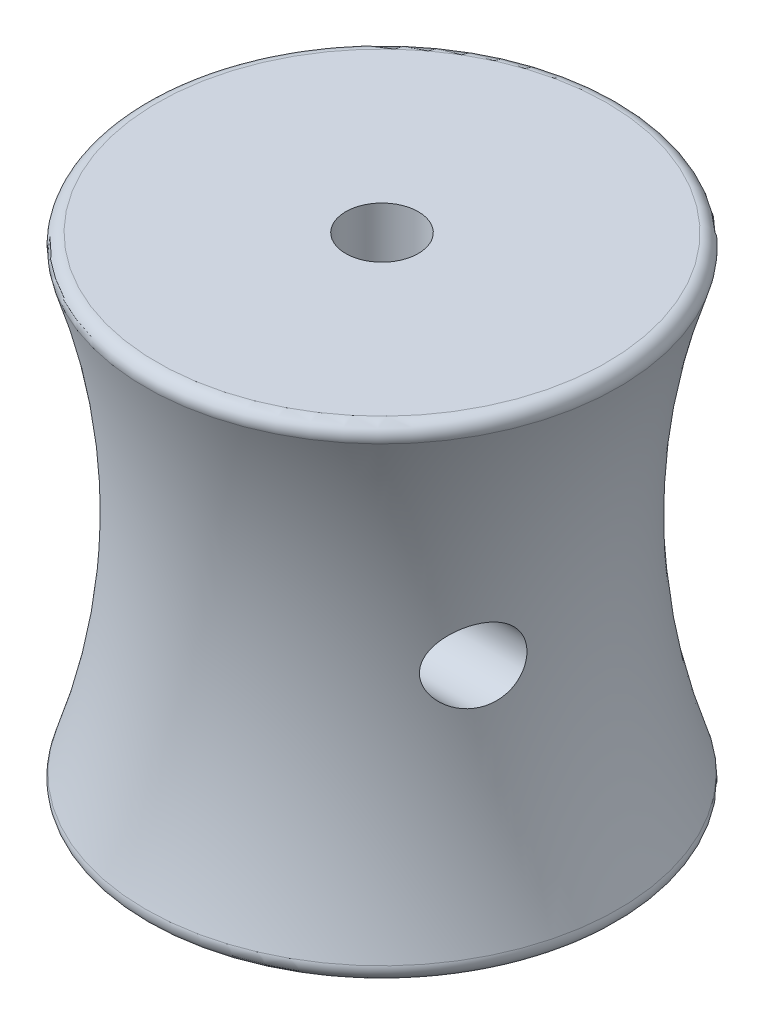
ISO-10303-21;
HEADER;
FILE_DESCRIPTION(('STEP AP214'),'2;1');
FILE_NAME('part.step','',(''),(''),'','','');
FILE_SCHEMA(('AUTOMOTIVE_DESIGN { 1 0 10303 214 1 1 1 1 }'));
ENDSEC;
DATA;
#1=APPLICATION_CONTEXT('core data for automotive mechanical design processes');
#2=APPLICATION_PROTOCOL_DEFINITION('international standard','automotive_design',2000,#1);
#3=PRODUCT_CONTEXT('',#1,'mechanical');
#4=PRODUCT('Part','Part','',(#3));
#5=PRODUCT_RELATED_PRODUCT_CATEGORY('part','',(#4));
#6=PRODUCT_DEFINITION_FORMATION('','',#4);
#7=PRODUCT_DEFINITION_CONTEXT('part definition',#1,'design');
#8=PRODUCT_DEFINITION('design','',#6,#7);
#9=PRODUCT_DEFINITION_SHAPE('','',#8);
#10=(LENGTH_UNIT() NAMED_UNIT(*) SI_UNIT(.MILLI.,.METRE.));
#11=(NAMED_UNIT(*) PLANE_ANGLE_UNIT() SI_UNIT($,.RADIAN.));
#12=(NAMED_UNIT(*) SI_UNIT($,.STERADIAN.) SOLID_ANGLE_UNIT());
#13=UNCERTAINTY_MEASURE_WITH_UNIT(LENGTH_MEASURE(1.E-05),#10,'distance_accuracy_value','');
#14=(GEOMETRIC_REPRESENTATION_CONTEXT(3) GLOBAL_UNCERTAINTY_ASSIGNED_CONTEXT((#13)) GLOBAL_UNIT_ASSIGNED_CONTEXT((#10,
#11,#12)) REPRESENTATION_CONTEXT('',''));
#15=CARTESIAN_POINT('',(0.,0.,0.));
#16=DIRECTION('',(0.,0.,1.));
#17=DIRECTION('',(1.,0.,0.));
#18=AXIS2_PLACEMENT_3D('',#15,#16,#17);
#19=CARTESIAN_POINT('',(0.,0.,0.));
#20=DIRECTION('',(0.,-1.,0.));
#21=DIRECTION('',(0.,0.,-1.));
#22=AXIS2_PLACEMENT_3D('',#19,#20,#21);
#23=CYLINDRICAL_SURFACE('',#22,5.);
#24=CARTESIAN_POINT('',(0.,7.,0.));
#25=DIRECTION('',(0.,-1.,0.));
#26=DIRECTION('',(0.,0.,-1.));
#27=AXIS2_PLACEMENT_3D('',#24,#25,#26);
#28=CIRCLE('',#27,5.);
#29=CARTESIAN_POINT('',(0.,7.,-5.));
#30=VERTEX_POINT('',#29);
#31=EDGE_CURVE('E115',#30,#30,#28,.T.);
#32=ORIENTED_EDGE('',*,*,#31,.F.);
#33=EDGE_LOOP('',(#32));
#34=FACE_BOUND('',#33,.T.);
#35=CARTESIAN_POINT('',(0.,0.,0.));
#36=DIRECTION('',(0.,-1.,0.));
#37=DIRECTION('',(0.,0.,-1.));
#38=AXIS2_PLACEMENT_3D('',#35,#36,#37);
#39=CIRCLE('',#38,5.);
#40=CARTESIAN_POINT('',(0.,0.,-5.));
#41=VERTEX_POINT('',#40);
#42=EDGE_CURVE('E103',#41,#41,#39,.T.);
#43=ORIENTED_EDGE('',*,*,#42,.T.);
#44=EDGE_LOOP('',(#43));
#45=FACE_BOUND('',#44,.T.);
#46=ADVANCED_FACE('F31',(#34,#45),#23,.F.);
#47=CARTESIAN_POINT('',(-5.,0.,0.));
#48=DIRECTION('',(0.,1.,0.));
#49=DIRECTION('',(0.,0.,1.));
#50=AXIS2_PLACEMENT_3D('',#47,#48,#49);
#51=PLANE('',#50);
#52=CARTESIAN_POINT('',(0.,0.,0.));
#53=DIRECTION('',(0.,1.,0.));
#54=DIRECTION('',(0.,0.,1.));
#55=AXIS2_PLACEMENT_3D('',#52,#53,#54);
#56=CIRCLE('',#55,18.5903643062003);
#57=CARTESIAN_POINT('',(0.,0.,18.5903643062003));
#58=VERTEX_POINT('',#57);
#59=EDGE_CURVE('E102',#58,#58,#56,.F.);
#60=ORIENTED_EDGE('',*,*,#59,.T.);
#61=EDGE_LOOP('',(#60));
#62=FACE_BOUND('',#61,.T.);
#63=ORIENTED_EDGE('',*,*,#42,.F.);
#64=EDGE_LOOP('',(#63));
#65=FACE_BOUND('',#64,.T.);
#66=ADVANCED_FACE('F80',(#62,#65),#51,.F.);
#67=CARTESIAN_POINT('',(0.,20.,0.));
#68=DIRECTION('',(0.,-1.,0.));
#69=DIRECTION('',(0.,0.,-1.));
#70=AXIS2_PLACEMENT_3D('',#67,#68,#69);
#71=TOROIDAL_SURFACE('',#70,75.,58.5234995535981);
#72=CARTESIAN_POINT('',(-15.7814763306211,17.8919481119362,4.86549319345604));
#73=CARTESIAN_POINT('',(-15.8123124430484,18.0075548162854,4.75132840425221));
#74=CARTESIAN_POINT('',(-15.8391156411163,18.1332122351452,4.64586822817748));
#75=CARTESIAN_POINT('',(-15.8852761691341,18.401178428891,4.45621871660962));
#76=CARTESIAN_POINT('',(-15.9046161394752,18.5435250331919,4.37207912730193));
#77=CARTESIAN_POINT('',(-15.9366092995384,18.8406347436881,4.22816347313094));
#78=CARTESIAN_POINT('',(-15.9492676503647,18.9953881596974,4.16836861178194));
#79=CARTESIAN_POINT('',(-15.9686273720257,19.312888912608,4.07506352770988));
#80=CARTESIAN_POINT('',(-15.9753316152622,19.4756323548999,4.0415406316899));
#81=CARTESIAN_POINT('',(-15.9832419125976,19.8042282200777,4.00183286332604));
#82=CARTESIAN_POINT('',(-15.9844587065578,19.9700739315847,3.99559459110639));
#83=CARTESIAN_POINT('',(-15.9815104094568,20.3004951818482,4.01050915060523));
#84=CARTESIAN_POINT('',(-15.977344860571,20.465070611356,4.03166431242195));
#85=CARTESIAN_POINT('',(-15.9633343761871,20.7883515255905,4.10071837285282));
#86=CARTESIAN_POINT('',(-15.9534865164621,20.9470539431697,4.14863104098805));
#87=CARTESIAN_POINT('',(-15.9274964884815,21.2539790605547,4.26966189783577));
#88=CARTESIAN_POINT('',(-15.9113546057053,21.4022022353098,4.34277894332984));
#89=CARTESIAN_POINT('',(-15.8719944422945,21.683896014962,4.51173783303915));
#90=CARTESIAN_POINT('',(-15.8487809162525,21.817376450174,4.6075643990104));
#91=CARTESIAN_POINT('',(-15.794494477893,22.0660487828897,4.81870534447793));
#92=CARTESIAN_POINT('',(-15.7634219632171,22.1812416052124,4.93401873790084));
#93=CARTESIAN_POINT('',(-15.6926845454639,22.3909935999027,5.18079582546267));
#94=CARTESIAN_POINT('',(-15.6529778365149,22.4854477214537,5.31233670135403));
#95=CARTESIAN_POINT('',(-15.5649076176164,22.6510682482933,5.58666286374436));
#96=CARTESIAN_POINT('',(-15.5165433361473,22.7222325765116,5.72944915174291));
#97=CARTESIAN_POINT('',(-15.4098872525771,22.8422097919337,6.02622366870613));
#98=CARTESIAN_POINT('',(-15.3513373044343,22.8902734293978,6.18042085373823));
#99=CARTESIAN_POINT('',(-15.2262966924725,22.960871814698,6.49138512667352));
#100=CARTESIAN_POINT('',(-15.1598035708778,22.9833986382023,6.64815299698557));
#101=CARTESIAN_POINT('',(-15.0149779157169,23.0045753182342,6.97197250754022));
#102=CARTESIAN_POINT('',(-14.9361319732751,23.0013152568485,7.13891727388768));
#103=CARTESIAN_POINT('',(-14.7728186916699,22.9679863398832,7.46724976224526));
#104=CARTESIAN_POINT('',(-14.6883493356314,22.9379078172262,7.62863545862398));
#105=CARTESIAN_POINT('',(-14.506967658496,22.8481574382478,7.95936484130184));
#106=CARTESIAN_POINT('',(-14.4096833006229,22.7856959761917,8.12774925940826));
#107=CARTESIAN_POINT('',(-14.2144316665526,22.6320287955977,8.45067242495582));
#108=CARTESIAN_POINT('',(-14.116463731058,22.54078994164,8.6051949464976));
#109=CARTESIAN_POINT('',(-13.9171923565044,22.3235868611679,8.90735458195164));
#110=CARTESIAN_POINT('',(-13.8161428239586,22.1956235349589,9.0537324229975));
#111=CARTESIAN_POINT('',(-13.6244605932449,21.9096840755354,9.32193322718962));
#112=CARTESIAN_POINT('',(-13.533809568845,21.7517620869839,9.44379968380988));
#113=CARTESIAN_POINT('',(-13.3957489236479,21.4598358993792,9.62466389713547));
#114=CARTESIAN_POINT('',(-13.3435390009018,21.3329546810077,9.6915417897336));
#115=CARTESIAN_POINT('',(-13.251698641695,21.0669645119872,9.80758432922389));
#116=CARTESIAN_POINT('',(-13.212055516728,20.9278680772945,9.85676684968522));
#117=CARTESIAN_POINT('',(-13.1644989538735,20.7118831580044,9.91528493796527));
#118=CARTESIAN_POINT('',(-13.1505940267853,20.6382953781221,9.93229244816527));
#119=CARTESIAN_POINT('',(-13.1272261764115,20.489379660797,9.9607839147016));
#120=CARTESIAN_POINT('',(-13.1177609761314,20.4140526362024,9.97227070251525));
#121=CARTESIAN_POINT('',(-13.1035555490304,20.2623249257438,9.98948351879703));
#122=CARTESIAN_POINT('',(-13.0988136137579,20.1859246382374,9.9952116302423));
#123=CARTESIAN_POINT('',(-13.0941859161627,20.0327888061868,10.0008007468946));
#124=CARTESIAN_POINT('',(-13.0942995662641,19.956053303331,10.0006624619962));
#125=CARTESIAN_POINT('',(-13.1012963041306,19.7463216379403,9.992214711466));
#126=CARTESIAN_POINT('',(-13.1131199917416,19.6136561687056,9.97794220066013));
#127=CARTESIAN_POINT('',(-13.1504722846804,19.3533613921768,9.93246787853743));
#128=CARTESIAN_POINT('',(-13.1760039084966,19.225733200739,9.90126233855028));
#129=CARTESIAN_POINT('',(-13.2391250497636,18.9766423383453,9.8231196640945));
#130=CARTESIAN_POINT('',(-13.276869624958,18.8552835769322,9.77597986172987));
#131=CARTESIAN_POINT('',(-13.3618336540901,18.6223960996197,9.66809032572558));
#132=CARTESIAN_POINT('',(-13.4090567294011,18.5108711643618,9.60733538922597));
#133=CARTESIAN_POINT('',(-13.5194694374315,18.2801102643612,9.4624454306872));
#134=CARTESIAN_POINT('',(-13.5840072808812,18.1629246318157,9.37608059058453));
#135=CARTESIAN_POINT('',(-13.7195665753543,17.9442651290516,9.18966452768595));
#136=CARTESIAN_POINT('',(-13.7905927038836,17.8428027383317,9.08960340471021));
#137=CARTESIAN_POINT('',(-13.9519285972731,17.6362367528782,8.85524310823645));
#138=CARTESIAN_POINT('',(-14.0431283941721,17.5349427544363,8.71818708922877));
#139=CARTESIAN_POINT('',(-14.2271746505556,17.357169342273,8.42974575565195));
#140=CARTESIAN_POINT('',(-14.3200222868231,17.2807084821734,8.2783498358663));
#141=CARTESIAN_POINT('',(-14.5154416529491,17.1462312985388,7.94458412750168));
#142=CARTESIAN_POINT('',(-14.6178033322547,17.0916444664876,7.76069570297423));
#143=CARTESIAN_POINT('',(-14.8164951769132,17.0182798782054,7.3825491545654));
#144=CARTESIAN_POINT('',(-14.9128259078869,16.9994987590062,7.18829200630421));
#145=CARTESIAN_POINT('',(-15.048700414716,17.0002593088512,6.89665655410815));
#146=CARTESIAN_POINT('',(-15.091982712992,17.0050650609268,6.80080394709574));
#147=CARTESIAN_POINT('',(-15.175939048724,17.0240430147961,6.60889981872552));
#148=CARTESIAN_POINT('',(-15.2166143875566,17.0382105026897,6.51284842171605));
#149=CARTESIAN_POINT('',(-15.2950482680423,17.0761144071376,6.32146348454283));
#150=CARTESIAN_POINT('',(-15.3328072662476,17.0998493222816,6.22612983413368));
#151=CARTESIAN_POINT('',(-15.4051663744196,17.156987321347,6.03718520147409));
#152=CARTESIAN_POINT('',(-15.439767287103,17.1903879394042,5.94357378632602));
#153=CARTESIAN_POINT('',(-15.4994769060399,17.2596724422847,5.77640072942866));
#154=CARTESIAN_POINT('',(-15.525151191845,17.2939261274434,5.70236112349399));
#155=CARTESIAN_POINT('',(-15.5742387697552,17.3687052870603,5.55674548501454));
#156=CARTESIAN_POINT('',(-15.5976524075511,17.4092298001302,5.48516907688659));
#157=CARTESIAN_POINT('',(-15.6421414005747,17.4962787576633,5.34526360535942));
#158=CARTESIAN_POINT('',(-15.663222337104,17.5427882784203,5.27692702465764));
#159=CARTESIAN_POINT('',(-15.703114689535,17.6416295909369,5.14394336773409));
#160=CARTESIAN_POINT('',(-15.7219273875949,17.6939580609772,5.07929421812728));
#161=CARTESIAN_POINT('',(-15.7469817520577,17.7719185287531,4.99080819281751));
#162=CARTESIAN_POINT('',(-15.7541440229091,17.7952771443647,4.96520325290637));
#163=CARTESIAN_POINT('',(-15.7680912515119,17.8429196639157,4.91476362619834));
#164=CARTESIAN_POINT('',(-15.774876171206,17.8672036607686,4.88992901720352));
#165=CARTESIAN_POINT('',(-15.7814763306211,17.8919481119362,4.86549319345604));
#166=B_SPLINE_CURVE_WITH_KNOTS('',3,(#72,#73,#74,#75,#76,#77,#78,#79,#80,#81,#82,#83,#84,#85,
#86,#87,#88,#89,#90,#91,#92,#93,#94,#95,#96,#97,#98,#99,#100,#101,#102,#103,#104,#105,#106,#107,
#108,#109,#110,#111,#112,#113,#114,#115,#116,#117,#118,#119,#120,#121,#122,#123,#124,#125,#126,
#127,#128,#129,#130,#131,#132,#133,#134,#135,#136,#137,#138,#139,#140,#141,#142,#143,#144,#145,
#146,#147,#148,#149,#150,#151,#152,#153,#154,#155,#156,#157,#158,#159,#160,#161,#162,#163,#164,
#165),.UNSPECIFIED.,.T.,.F.,(4,2,2,2,2,2,2,2,2,2,2,2,2,2,2,2,2,2,2,2,2,2,2,2,2,2,2,2,2,2,2,2,2,
2,2,2,2,2,2,2,2,2,2,2,2,2,4),(0.,0.495999502745812,0.993145853932395,1.48990762876241,
1.98642962361593,2.48197941847064,2.97757136779034,3.47341858605045,3.96924331666515,
4.46473541441315,4.96020244675019,5.4581241283239,5.9560902043111,6.4692690575917,
6.98260711190947,7.53430295236701,8.08619773949452,8.69637181193445,9.30725104353511,
9.96132146209641,10.6142208427927,11.0704659337361,11.5262488826822,11.7563496473737,
11.986332271329,12.2162316780555,12.4461032646599,12.8458517686368,13.2456883333846,
13.6508147599492,14.0560962655057,14.5320986754695,15.0084469926708,15.5860397284997,
16.1640630146633,16.8132457903652,17.4623675900823,17.7778441853692,18.09316205015,
18.4084304515492,18.7236184940982,18.9799117958219,19.236165843759,19.4917928702492,
19.7472747152022,19.8534277285813,19.9595914285492),.UNSPECIFIED.);
#167=CARTESIAN_POINT('',(-15.7814763306211,17.8919481119362,4.86549319345604));
#168=VERTEX_POINT('',#167);
#169=EDGE_CURVE('E35',#168,#168,#166,.T.);
#170=ORIENTED_EDGE('',*,*,#169,.T.);
#171=EDGE_LOOP('',(#170));
#172=FACE_BOUND('',#171,.T.);
#173=CARTESIAN_POINT('',(15.6326833357427,17.4783624583369,5.37477716446647));
#174=CARTESIAN_POINT('',(15.6097173523748,17.4312900872063,5.44781600710138));
#175=CARTESIAN_POINT('',(15.5854813972395,17.3875616059773,5.52264384589838));
#176=CARTESIAN_POINT('',(15.5344995252752,17.3070134446844,5.67513094384286));
#177=CARTESIAN_POINT('',(15.507752005269,17.2701982230707,5.75279199187525));
#178=CARTESIAN_POINT('',(15.4236913996821,17.1701973781903,5.98931330240259));
#179=CARTESIAN_POINT('',(15.3626347536374,17.1176099046555,6.15147103953682));
#180=CARTESIAN_POINT('',(15.2319891287524,17.0410211693093,6.47797833905184));
#181=CARTESIAN_POINT('',(15.1624395270941,17.016893123097,6.64231485682073));
#182=CARTESIAN_POINT('',(15.0161247603376,16.9956869459465,6.96935206323831));
#183=CARTESIAN_POINT('',(14.9393629990076,16.9985961176811,7.13205348383259));
#184=CARTESIAN_POINT('',(14.7743401781689,17.0311271138728,7.4645623165047));
#185=CARTESIAN_POINT('',(14.6856487599985,17.062785787417,7.63395412903727));
#186=CARTESIAN_POINT('',(14.5046204853496,17.1536995443833,7.96321779102475));
#187=CARTESIAN_POINT('',(14.4122804845707,17.212978927573,8.12308111767344));
#188=CARTESIAN_POINT('',(14.2175658841899,17.3647710837563,8.44586892682231));
#189=CARTESIAN_POINT('',(14.1151232561747,17.4600443208976,8.6074599545489));
#190=CARTESIAN_POINT('',(13.9141409045949,17.68040225438,8.91173604996663));
#191=CARTESIAN_POINT('',(13.8156002906307,17.8054801033646,9.05442544844849));
#192=CARTESIAN_POINT('',(13.6451059843795,18.0592821011503,9.29309949359607));
#193=CARTESIAN_POINT('',(13.571547270252,18.1833644071984,9.39287403004466));
#194=CARTESIAN_POINT('',(13.4353095978877,18.4498985362984,9.57352122321484));
#195=CARTESIAN_POINT('',(13.3726146410512,18.5923227992974,9.65442173683876));
#196=CARTESIAN_POINT('',(13.2731882655718,18.8658130855287,9.7806364812776));
#197=CARTESIAN_POINT('',(13.2338020871205,18.9941461254658,9.82975975959463));
#198=CARTESIAN_POINT('',(13.1685155486078,19.2595013918372,9.91047133966973));
#199=CARTESIAN_POINT('',(13.142604845871,19.3965168634589,9.94207309075718));
#200=CARTESIAN_POINT('',(13.1065621890009,19.6764812352814,9.98588337438492));
#201=CARTESIAN_POINT('',(13.0965155689656,19.8194580065976,9.99798703219548));
#202=CARTESIAN_POINT('',(13.0935672690403,20.1058430427622,10.0015479556856));
#203=CARTESIAN_POINT('',(13.1006628798752,20.249251235848,9.99300848394613));
#204=CARTESIAN_POINT('',(13.1298775079158,20.5194039063839,9.95756396166223));
#205=CARTESIAN_POINT('',(13.1506510351251,20.6465203242363,9.9323027273151));
#206=CARTESIAN_POINT('',(13.20413127432,20.8940819187076,9.86653722016511));
#207=CARTESIAN_POINT('',(13.2368413802913,21.0145251866872,9.82602861189895));
#208=CARTESIAN_POINT('',(13.3149313540061,21.2557602193326,9.72788002053888));
#209=CARTESIAN_POINT('',(13.3610997727297,21.3758480506717,9.66915121922029));
#210=CARTESIAN_POINT('',(13.4619756076086,21.6045260857065,9.53828289294015));
#211=CARTESIAN_POINT('',(13.5166874167893,21.7131103257535,9.46613646494711));
#212=CARTESIAN_POINT('',(13.6437908138966,21.9386667755888,9.29466091905699));
#213=CARTESIAN_POINT('',(13.7175261295929,22.0529421797861,9.19278265634861));
#214=CARTESIAN_POINT('',(13.8702144237384,22.263219930411,8.97503987940672));
#215=CARTESIAN_POINT('',(13.9491713615588,22.3592081912791,8.85916469548039));
#216=CARTESIAN_POINT('',(14.1252310096629,22.5493309517861,8.59150194390335));
#217=CARTESIAN_POINT('',(14.2228475017978,22.6393851746535,8.43713415690369));
#218=CARTESIAN_POINT('',(14.417418405602,22.7909872778706,8.11454275937686));
#219=CARTESIAN_POINT('',(14.5143723779765,22.8525177687252,7.94631076994316));
#220=CARTESIAN_POINT('',(14.7112201617006,22.9484221296612,7.58641764883708));
#221=CARTESIAN_POINT('',(14.8108064846541,22.9804682348533,7.39394328317589));
#222=CARTESIAN_POINT('',(14.9536749701659,22.9999282946126,7.10041963771979));
#223=CARTESIAN_POINT('',(15.0002328043925,23.0016409190261,7.00172930237633));
#224=CARTESIAN_POINT('',(15.09079835544,22.9951977416055,6.80352445795516));
#225=CARTESIAN_POINT('',(15.1348075261183,22.987047625142,6.70401045650864));
#226=CARTESIAN_POINT('',(15.217020551948,22.9614930215135,6.5118276706069));
#227=CARTESIAN_POINT('',(15.2554157135349,22.944752851753,6.41915184964065));
#228=CARTESIAN_POINT('',(15.3293962188296,22.9023074221821,6.23478494356133));
#229=CARTESIAN_POINT('',(15.3649830441319,22.8766069288752,6.14309336155418));
#230=CARTESIAN_POINT('',(15.4331488928612,22.8161835263302,5.9616132997852));
#231=CARTESIAN_POINT('',(15.4657291100087,22.7814642189212,5.87182407572947));
#232=CARTESIAN_POINT('',(15.5277442879984,22.703092395044,5.69514515080188));
#233=CARTESIAN_POINT('',(15.5571796117046,22.6594409108864,5.608255116213));
#234=CARTESIAN_POINT('',(15.634508151087,22.5259187298125,5.3721853943469));
#235=CARTESIAN_POINT('',(15.678953755033,22.4265039853561,5.22711383060368));
#236=CARTESIAN_POINT('',(15.7577120734098,22.2022190315666,4.95517439185774));
#237=CARTESIAN_POINT('',(15.7920286704332,22.0773586070301,4.82829955140412));
#238=CARTESIAN_POINT('',(15.8493464246396,21.8147723441054,4.6053614209882));
#239=CARTESIAN_POINT('',(15.8729418404081,21.6784262618894,4.50782362508342));
#240=CARTESIAN_POINT('',(15.9127820045212,21.3905941117889,4.33648884100785));
#241=CARTESIAN_POINT('',(15.9290276959288,21.2391099893548,4.26268880733159));
#242=CARTESIAN_POINT('',(15.954772058233,20.9283204100771,4.14246940939173));
#243=CARTESIAN_POINT('',(15.9643885081837,20.7692082694179,4.09557470024206));
#244=CARTESIAN_POINT('',(15.9779526591912,20.4451995343933,4.02860929803914));
#245=CARTESIAN_POINT('',(15.9819003436426,20.2803029230851,4.00853868356107));
#246=CARTESIAN_POINT('',(15.9844045652646,19.9495587018242,3.99586596220043));
#247=CARTESIAN_POINT('',(15.9829656814727,19.7837120192244,4.00324052457099));
#248=CARTESIAN_POINT('',(15.9746041372895,19.4556495992391,4.04516899450036));
#249=CARTESIAN_POINT('',(15.9676820470941,19.293433486116,4.07972007598415));
#250=CARTESIAN_POINT('',(15.9478882424779,18.9772128044087,4.1749047624549));
#251=CARTESIAN_POINT('',(15.935016354069,18.8232084761061,4.23553913018425));
#252=CARTESIAN_POINT('',(15.902598310264,18.5277340950331,4.38092162882742));
#253=CARTESIAN_POINT('',(15.883048997035,18.3862700126335,4.46568116565131));
#254=CARTESIAN_POINT('',(15.8364240445814,18.1197797855627,4.65658247892334));
#255=CARTESIAN_POINT('',(15.8093449678009,17.9947611872243,4.76273401533336));
#256=CARTESIAN_POINT('',(15.7626547356114,17.8223586760646,4.93493362917174));
#257=CARTESIAN_POINT('',(15.746091191119,17.7674406082557,4.99445579745452));
#258=CARTESIAN_POINT('',(15.7108734852287,17.6628703584937,5.11736440255889));
#259=CARTESIAN_POINT('',(15.6922204165138,17.6132154504521,5.18074881184772));
#260=CARTESIAN_POINT('',(15.6596840602642,17.5358293030113,5.28810279230206));
#261=CARTESIAN_POINT('',(15.6464105587501,17.5064985466396,5.33112040198472));
#262=CARTESIAN_POINT('',(15.6326833357427,17.4783624583369,5.37477716446647));
#263=B_SPLINE_CURVE_WITH_KNOTS('',3,(#173,#174,#175,#176,#177,#178,#179,#180,#181,#182,#183,
#184,#185,#186,#187,#188,#189,#190,#191,#192,#193,#194,#195,#196,#197,#198,#199,#200,#201,#202,
#203,#204,#205,#206,#207,#208,#209,#210,#211,#212,#213,#214,#215,#216,#217,#218,#219,#220,#221,
#222,#223,#224,#225,#226,#227,#228,#229,#230,#231,#232,#233,#234,#235,#236,#237,#238,#239,#240,
#241,#242,#243,#244,#245,#246,#247,#248,#249,#250,#251,#252,#253,#254,#255,#256,#257,#258,#259,
#260,#261,#262),.UNSPECIFIED.,.T.,.F.,(4,2,2,2,2,2,2,2,2,2,2,2,2,2,2,2,2,2,2,2,2,2,2,2,2,2,2,2,
2,2,2,2,2,2,2,2,2,2,2,2,2,2,2,2,4),(0.,0.269582505807605,0.539338276203202,1.07972280776871,
1.61769076762691,2.1554060975798,2.73446866143082,3.31404162966441,3.95238621146597,
4.59058428017171,5.11478848145794,5.63821402435735,6.06531672823992,6.49209113735885,
6.92115347198682,7.3501479991111,7.74222264312772,8.13440885461239,8.55715024931286,
8.98010973851522,9.48803459757657,9.99634911476606,10.6046718151489,11.2133648933526,
11.8667859862135,12.1938013952262,12.5206283861766,12.8253152386231,13.129840257557,
13.4342438453118,13.738612272348,14.2796804685403,14.8205409954449,15.3259494522426,
15.8312930402995,16.3274094468576,16.8235273066746,17.3192235202647,17.8148681934236,
18.3105273614933,18.8064212579197,19.302541917056,19.5503039184415,19.7979369562205,
19.9590717579328),.UNSPECIFIED.);
#264=CARTESIAN_POINT('',(15.6326833357427,17.4783624583369,5.37477716446647));
#265=VERTEX_POINT('',#264);
#266=EDGE_CURVE('E52',#265,#265,#263,.T.);
#267=ORIENTED_EDGE('',*,*,#266,.T.);
#268=EDGE_LOOP('',(#267));
#269=FACE_BOUND('',#268,.T.);
#270=CARTESIAN_POINT('',(0.,1.31920166224251,0.));
#271=DIRECTION('',(0.,1.,0.));
#272=DIRECTION('',(0.,0.,1.));
#273=AXIS2_PLACEMENT_3D('',#270,#271,#272);
#274=CIRCLE('',#273,19.5380511209348);
#275=CARTESIAN_POINT('',(0.,1.31920166224251,19.5380511209348));
#276=VERTEX_POINT('',#275);
#277=EDGE_CURVE('E44',#276,#276,#274,.T.);
#278=ORIENTED_EDGE('',*,*,#277,.T.);
#279=EDGE_LOOP('',(#278));
#280=FACE_BOUND('',#279,.T.);
#281=CARTESIAN_POINT('',(0.,38.6807983377575,0.));
#282=DIRECTION('',(0.,-1.,0.));
#283=DIRECTION('',(0.,0.,-1.));
#284=AXIS2_PLACEMENT_3D('',#281,#282,#283);
#285=CIRCLE('',#284,19.5380511209348);
#286=CARTESIAN_POINT('',(0.,38.6807983377575,-19.5380511209348));
#287=VERTEX_POINT('',#286);
#288=EDGE_CURVE('E49',#287,#287,#285,.T.);
#289=ORIENTED_EDGE('',*,*,#288,.T.);
#290=EDGE_LOOP('',(#289));
#291=FACE_BOUND('',#290,.T.);
#292=ADVANCED_FACE('F57',(#172,#269,#280,#291),#71,.F.);
#293=CARTESIAN_POINT('',(-3.,40.,0.));
#294=DIRECTION('',(0.,-1.,0.));
#295=DIRECTION('',(0.,0.,-1.));
#296=AXIS2_PLACEMENT_3D('',#293,#294,#295);
#297=PLANE('',#296);
#298=CARTESIAN_POINT('',(0.,40.,0.));
#299=DIRECTION('',(0.,-1.,0.));
#300=DIRECTION('',(0.,0.,-1.));
#301=AXIS2_PLACEMENT_3D('',#298,#299,#300);
#302=CIRCLE('',#301,18.5903643062003);
#303=CARTESIAN_POINT('',(0.,40.,-18.5903643062003));
#304=VERTEX_POINT('',#303);
#305=EDGE_CURVE('E10',#304,#304,#302,.F.);
#306=ORIENTED_EDGE('',*,*,#305,.T.);
#307=EDGE_LOOP('',(#306));
#308=FACE_BOUND('',#307,.T.);
#309=CARTESIAN_POINT('',(0.,40.,0.));
#310=DIRECTION('',(0.,-1.,0.));
#311=DIRECTION('',(0.,0.,-1.));
#312=AXIS2_PLACEMENT_3D('',#309,#310,#311);
#313=CIRCLE('',#312,3.);
#314=CARTESIAN_POINT('',(0.,40.,-3.));
#315=VERTEX_POINT('',#314);
#316=EDGE_CURVE('E107',#315,#315,#313,.T.);
#317=ORIENTED_EDGE('',*,*,#316,.T.);
#318=EDGE_LOOP('',(#317));
#319=FACE_BOUND('',#318,.T.);
#320=ADVANCED_FACE('F74',(#308,#319),#297,.F.);
#321=CARTESIAN_POINT('',(0.,0.,0.));
#322=DIRECTION('',(0.,-1.,0.));
#323=DIRECTION('',(0.,0.,-1.));
#324=AXIS2_PLACEMENT_3D('',#321,#322,#323);
#325=CYLINDRICAL_SURFACE('',#324,3.);
#326=ORIENTED_EDGE('',*,*,#316,.F.);
#327=EDGE_LOOP('',(#326));
#328=FACE_BOUND('',#327,.T.);
#329=CARTESIAN_POINT('',(0.,7.,0.));
#330=DIRECTION('',(0.,-1.,0.));
#331=DIRECTION('',(0.,0.,-1.));
#332=AXIS2_PLACEMENT_3D('',#329,#330,#331);
#333=CIRCLE('',#332,3.);
#334=CARTESIAN_POINT('',(0.,7.,-3.));
#335=VERTEX_POINT('',#334);
#336=EDGE_CURVE('E112',#335,#335,#333,.T.);
#337=ORIENTED_EDGE('',*,*,#336,.T.);
#338=EDGE_LOOP('',(#337));
#339=FACE_BOUND('',#338,.T.);
#340=ADVANCED_FACE('F71',(#328,#339),#325,.F.);
#341=CARTESIAN_POINT('',(-5.,7.,0.));
#342=DIRECTION('',(0.,1.,0.));
#343=DIRECTION('',(0.,0.,1.));
#344=AXIS2_PLACEMENT_3D('',#341,#342,#343);
#345=PLANE('',#344);
#346=ORIENTED_EDGE('',*,*,#336,.F.);
#347=EDGE_LOOP('',(#346));
#348=FACE_BOUND('',#347,.T.);
#349=ORIENTED_EDGE('',*,*,#31,.T.);
#350=EDGE_LOOP('',(#349));
#351=FACE_BOUND('',#350,.T.);
#352=ADVANCED_FACE('F66',(#348,#351),#345,.F.);
#353=CARTESIAN_POINT('',(0.,0.999999999999997,0.));
#354=DIRECTION('',(0.,-1.,0.));
#355=DIRECTION('',(0.,0.,-1.));
#356=AXIS2_PLACEMENT_3D('',#353,#354,#355);
#357=TOROIDAL_SURFACE('',#356,18.5903643062003,1.);
#358=ORIENTED_EDGE('',*,*,#277,.F.);
#359=EDGE_LOOP('',(#358));
#360=FACE_BOUND('',#359,.T.);
#361=ORIENTED_EDGE('',*,*,#59,.F.);
#362=EDGE_LOOP('',(#361));
#363=FACE_BOUND('',#362,.T.);
#364=ADVANCED_FACE('F70',(#360,#363),#357,.T.);
#365=CARTESIAN_POINT('',(0.,39.,0.));
#366=DIRECTION('',(0.,1.,0.));
#367=DIRECTION('',(0.,0.,1.));
#368=AXIS2_PLACEMENT_3D('',#365,#366,#367);
#369=TOROIDAL_SURFACE('',#368,18.5903643062003,1.);
#370=ORIENTED_EDGE('',*,*,#305,.F.);
#371=EDGE_LOOP('',(#370));
#372=FACE_BOUND('',#371,.T.);
#373=ORIENTED_EDGE('',*,*,#288,.F.);
#374=EDGE_LOOP('',(#373));
#375=FACE_BOUND('',#374,.T.);
#376=ADVANCED_FACE('F33',(#372,#375),#369,.T.);
#377=CARTESIAN_POINT('',(-19.5903643062003,20.,7.));
#378=DIRECTION('',(1.,0.,0.));
#379=DIRECTION('',(0.,0.,-1.));
#380=AXIS2_PLACEMENT_3D('',#377,#378,#379);
#381=CYLINDRICAL_SURFACE('',#380,3.);
#382=ORIENTED_EDGE('',*,*,#266,.F.);
#383=EDGE_LOOP('',(#382));
#384=FACE_BOUND('',#383,.T.);
#385=ORIENTED_EDGE('',*,*,#169,.F.);
#386=EDGE_LOOP('',(#385));
#387=FACE_BOUND('',#386,.T.);
#388=ADVANCED_FACE('F61',(#384,#387),#381,.F.);
#389=CLOSED_SHELL('',(#46,#66,#292,#320,#340,#352,#364,#376,#388));
#390=MANIFOLD_SOLID_BREP('B2',#389);
#391=ADVANCED_BREP_SHAPE_REPRESENTATION('',(#18,#390),#14);
#392=SHAPE_DEFINITION_REPRESENTATION(#9,#391);
ENDSEC;
END-ISO-10303-21;
